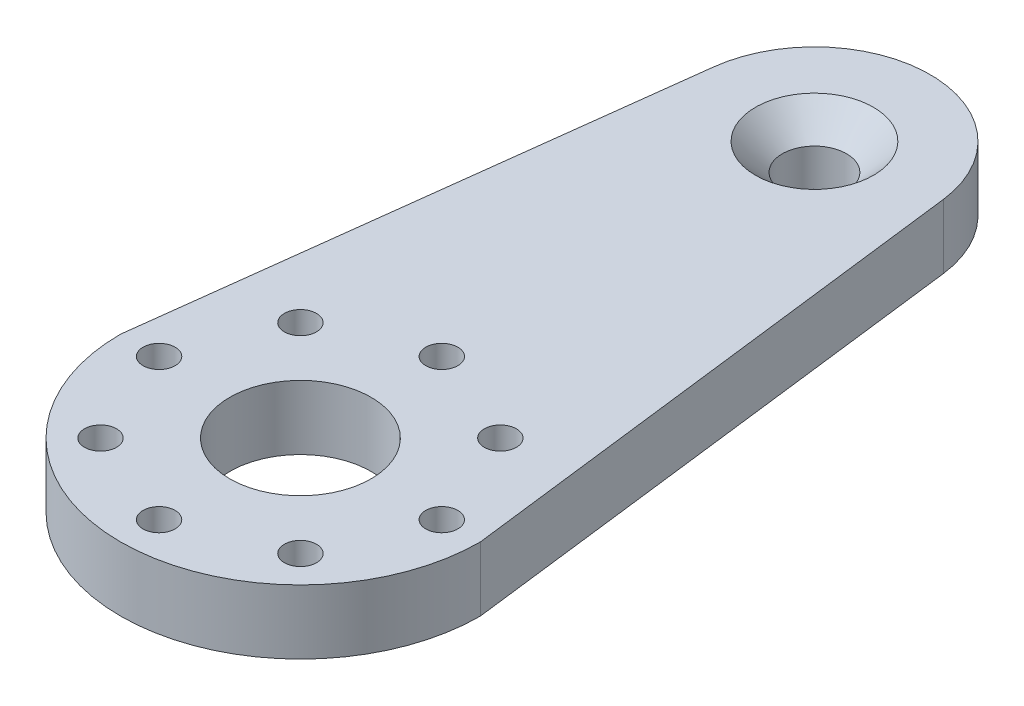
ISO-10303-21;
HEADER;
FILE_DESCRIPTION(('STEP AP214'),'2;1');
FILE_NAME('part.step','',(''),(''),'','','');
FILE_SCHEMA(('AUTOMOTIVE_DESIGN { 1 0 10303 214 1 1 1 1 }'));
ENDSEC;
DATA;
#1=APPLICATION_CONTEXT('core data for automotive mechanical design processes');
#2=APPLICATION_PROTOCOL_DEFINITION('international standard','automotive_design',2000,#1);
#3=PRODUCT_CONTEXT('',#1,'mechanical');
#4=PRODUCT('Part','Part','',(#3));
#5=PRODUCT_RELATED_PRODUCT_CATEGORY('part','',(#4));
#6=PRODUCT_DEFINITION_FORMATION('','',#4);
#7=PRODUCT_DEFINITION_CONTEXT('part definition',#1,'design');
#8=PRODUCT_DEFINITION('design','',#6,#7);
#9=PRODUCT_DEFINITION_SHAPE('','',#8);
#10=(LENGTH_UNIT() NAMED_UNIT(*) SI_UNIT(.MILLI.,.METRE.));
#11=(NAMED_UNIT(*) PLANE_ANGLE_UNIT() SI_UNIT($,.RADIAN.));
#12=(NAMED_UNIT(*) SI_UNIT($,.STERADIAN.) SOLID_ANGLE_UNIT());
#13=UNCERTAINTY_MEASURE_WITH_UNIT(LENGTH_MEASURE(1.E-05),#10,'distance_accuracy_value','');
#14=(GEOMETRIC_REPRESENTATION_CONTEXT(3) GLOBAL_UNCERTAINTY_ASSIGNED_CONTEXT((#13)) GLOBAL_UNIT_ASSIGNED_CONTEXT((#10,
#11,#12)) REPRESENTATION_CONTEXT('',''));
#15=CARTESIAN_POINT('',(0.,0.,0.));
#16=DIRECTION('',(0.,0.,1.));
#17=DIRECTION('',(1.,0.,0.));
#18=AXIS2_PLACEMENT_3D('',#15,#16,#17);
#19=CARTESIAN_POINT('',(0.,5.,0.));
#20=DIRECTION('',(0.,1.,0.));
#21=DIRECTION('',(0.,0.,1.));
#22=AXIS2_PLACEMENT_3D('',#19,#20,#21);
#23=PLANE('',#22);
#24=CARTESIAN_POINT('',(0.,5.,-40.));
#25=DIRECTION('',(0.,1.,0.));
#26=DIRECTION('',(0.,0.,1.));
#27=AXIS2_PLACEMENT_3D('',#24,#25,#26);
#28=CIRCLE('',#27,4.59);
#29=CARTESIAN_POINT('',(0.,5.,-35.41));
#30=VERTEX_POINT('',#29);
#31=EDGE_CURVE('E98',#30,#30,#28,.T.);
#32=ORIENTED_EDGE('',*,*,#31,.F.);
#33=EDGE_LOOP('',(#32));
#34=FACE_BOUND('',#33,.T.);
#35=DIRECTION('',(0.122369609545525,0.,-0.992484598701499));
#36=VECTOR('',#35,1.);
#37=CARTESIAN_POINT('',(-13.7903595012355,5.,-1.70029933952269));
#38=LINE('',#37,#36);
#39=CARTESIAN_POINT('',(-14.,5.,0.));
#40=VERTEX_POINT('',#39);
#41=CARTESIAN_POINT('',(-8.93236138831349,5.,-41.1013264859097));
#42=VERTEX_POINT('',#41);
#43=EDGE_CURVE('E93',#40,#42,#38,.T.);
#44=ORIENTED_EDGE('',*,*,#43,.F.);
#45=CARTESIAN_POINT('',(0.,5.,0.));
#46=DIRECTION('',(0.,1.,0.));
#47=DIRECTION('',(0.,0.,1.));
#48=AXIS2_PLACEMENT_3D('',#45,#46,#47);
#49=CIRCLE('',#48,14.);
#50=CARTESIAN_POINT('',(14.,5.,0.));
#51=VERTEX_POINT('',#50);
#52=EDGE_CURVE('E162',#40,#51,#49,.T.);
#53=ORIENTED_EDGE('',*,*,#52,.T.);
#54=DIRECTION('',(-0.122369609545525,0.,-0.992484598701499));
#55=VECTOR('',#54,1.);
#56=CARTESIAN_POINT('',(13.7903595012355,5.,-1.70029933952269));
#57=LINE('',#56,#55);
#58=CARTESIAN_POINT('',(8.93236138831349,5.,-41.1013264859097));
#59=VERTEX_POINT('',#58);
#60=EDGE_CURVE('E95',#51,#59,#57,.T.);
#61=ORIENTED_EDGE('',*,*,#60,.T.);
#62=CARTESIAN_POINT('',(0.,5.,-40.));
#63=DIRECTION('',(0.,1.,0.));
#64=DIRECTION('',(0.,0.,1.));
#65=AXIS2_PLACEMENT_3D('',#62,#63,#64);
#66=CIRCLE('',#65,9.);
#67=EDGE_CURVE('E88',#59,#42,#66,.T.);
#68=ORIENTED_EDGE('',*,*,#67,.T.);
#69=EDGE_LOOP('',(#44,#53,#61,#68));
#70=FACE_BOUND('',#69,.T.);
#71=CARTESIAN_POINT('',(-7.77817459305202,5.,-7.77817459305202));
#72=DIRECTION('',(0.,1.,0.));
#73=DIRECTION('',(0.,0.,1.));
#74=AXIS2_PLACEMENT_3D('',#71,#72,#73);
#75=CIRCLE('',#74,1.25);
#76=CARTESIAN_POINT('',(-7.77817459305202,5.,-6.52817459305202));
#77=VERTEX_POINT('',#76);
#78=EDGE_CURVE('E103',#77,#77,#75,.T.);
#79=ORIENTED_EDGE('',*,*,#78,.F.);
#80=EDGE_LOOP('',(#79));
#81=FACE_BOUND('',#80,.T.);
#82=CARTESIAN_POINT('',(-11.,5.,0.));
#83=DIRECTION('',(0.,1.,0.));
#84=DIRECTION('',(0.,0.,1.));
#85=AXIS2_PLACEMENT_3D('',#82,#83,#84);
#86=CIRCLE('',#85,1.25);
#87=CARTESIAN_POINT('',(-11.,5.,1.25));
#88=VERTEX_POINT('',#87);
#89=EDGE_CURVE('E108',#88,#88,#86,.T.);
#90=ORIENTED_EDGE('',*,*,#89,.F.);
#91=EDGE_LOOP('',(#90));
#92=FACE_BOUND('',#91,.T.);
#93=CARTESIAN_POINT('',(-7.77817459305202,5.,7.77817459305202));
#94=DIRECTION('',(0.,1.,0.));
#95=DIRECTION('',(0.,0.,1.));
#96=AXIS2_PLACEMENT_3D('',#93,#94,#95);
#97=CIRCLE('',#96,1.25);
#98=CARTESIAN_POINT('',(-7.77817459305202,5.,9.02817459305202));
#99=VERTEX_POINT('',#98);
#100=EDGE_CURVE('E114',#99,#99,#97,.T.);
#101=ORIENTED_EDGE('',*,*,#100,.F.);
#102=EDGE_LOOP('',(#101));
#103=FACE_BOUND('',#102,.T.);
#104=CARTESIAN_POINT('',(0.,5.,11.));
#105=DIRECTION('',(0.,1.,0.));
#106=DIRECTION('',(0.,0.,1.));
#107=AXIS2_PLACEMENT_3D('',#104,#105,#106);
#108=CIRCLE('',#107,1.25);
#109=CARTESIAN_POINT('',(0.,5.,12.25));
#110=VERTEX_POINT('',#109);
#111=EDGE_CURVE('E120',#110,#110,#108,.T.);
#112=ORIENTED_EDGE('',*,*,#111,.F.);
#113=EDGE_LOOP('',(#112));
#114=FACE_BOUND('',#113,.T.);
#115=CARTESIAN_POINT('',(7.77817459305202,5.,7.77817459305202));
#116=DIRECTION('',(0.,1.,0.));
#117=DIRECTION('',(0.,0.,1.));
#118=AXIS2_PLACEMENT_3D('',#115,#116,#117);
#119=CIRCLE('',#118,1.25);
#120=CARTESIAN_POINT('',(7.77817459305202,5.,9.02817459305202));
#121=VERTEX_POINT('',#120);
#122=EDGE_CURVE('E126',#121,#121,#119,.T.);
#123=ORIENTED_EDGE('',*,*,#122,.F.);
#124=EDGE_LOOP('',(#123));
#125=FACE_BOUND('',#124,.T.);
#126=CARTESIAN_POINT('',(11.,5.,0.));
#127=DIRECTION('',(0.,1.,0.));
#128=DIRECTION('',(0.,0.,1.));
#129=AXIS2_PLACEMENT_3D('',#126,#127,#128);
#130=CIRCLE('',#129,1.25);
#131=CARTESIAN_POINT('',(11.,5.,1.25));
#132=VERTEX_POINT('',#131);
#133=EDGE_CURVE('E132',#132,#132,#130,.T.);
#134=ORIENTED_EDGE('',*,*,#133,.F.);
#135=EDGE_LOOP('',(#134));
#136=FACE_BOUND('',#135,.T.);
#137=CARTESIAN_POINT('',(7.77817459305202,5.,-7.77817459305202));
#138=DIRECTION('',(0.,1.,0.));
#139=DIRECTION('',(0.,0.,1.));
#140=AXIS2_PLACEMENT_3D('',#137,#138,#139);
#141=CIRCLE('',#140,1.25);
#142=CARTESIAN_POINT('',(7.77817459305202,5.,-6.52817459305202));
#143=VERTEX_POINT('',#142);
#144=EDGE_CURVE('E138',#143,#143,#141,.T.);
#145=ORIENTED_EDGE('',*,*,#144,.F.);
#146=EDGE_LOOP('',(#145));
#147=FACE_BOUND('',#146,.T.);
#148=CARTESIAN_POINT('',(0.,5.,-11.));
#149=DIRECTION('',(0.,1.,0.));
#150=DIRECTION('',(0.,0.,1.));
#151=AXIS2_PLACEMENT_3D('',#148,#149,#150);
#152=CIRCLE('',#151,1.25);
#153=CARTESIAN_POINT('',(0.,5.,-9.75));
#154=VERTEX_POINT('',#153);
#155=EDGE_CURVE('E144',#154,#154,#152,.T.);
#156=ORIENTED_EDGE('',*,*,#155,.F.);
#157=EDGE_LOOP('',(#156));
#158=FACE_BOUND('',#157,.T.);
#159=CARTESIAN_POINT('',(0.,5.,0.));
#160=DIRECTION('',(0.,1.,0.));
#161=DIRECTION('',(0.,0.,1.));
#162=AXIS2_PLACEMENT_3D('',#159,#160,#161);
#163=CIRCLE('',#162,5.5);
#164=CARTESIAN_POINT('',(0.,5.,5.5));
#165=VERTEX_POINT('',#164);
#166=EDGE_CURVE('E153',#165,#165,#163,.T.);
#167=ORIENTED_EDGE('',*,*,#166,.F.);
#168=EDGE_LOOP('',(#167));
#169=FACE_BOUND('',#168,.T.);
#170=ADVANCED_FACE('F34',(#34,#70,#81,#92,#103,#114,#125,#136,#147,#158,#169),#23,.T.);
#171=CARTESIAN_POINT('',(0.,0.,0.));
#172=DIRECTION('',(0.,1.,0.));
#173=DIRECTION('',(0.,0.,1.));
#174=AXIS2_PLACEMENT_3D('',#171,#172,#173);
#175=PLANE('',#174);
#176=CARTESIAN_POINT('',(-7.77817459305202,0.,-7.77817459305202));
#177=DIRECTION('',(0.,1.,0.));
#178=DIRECTION('',(0.,0.,1.));
#179=AXIS2_PLACEMENT_3D('',#176,#177,#178);
#180=CIRCLE('',#179,1.25);
#181=CARTESIAN_POINT('',(-7.77817459305202,0.,-6.52817459305202));
#182=VERTEX_POINT('',#181);
#183=EDGE_CURVE('E105',#182,#182,#180,.T.);
#184=ORIENTED_EDGE('',*,*,#183,.T.);
#185=EDGE_LOOP('',(#184));
#186=FACE_BOUND('',#185,.T.);
#187=CARTESIAN_POINT('',(-11.,0.,0.));
#188=DIRECTION('',(0.,1.,0.));
#189=DIRECTION('',(0.,0.,1.));
#190=AXIS2_PLACEMENT_3D('',#187,#188,#189);
#191=CIRCLE('',#190,1.25);
#192=CARTESIAN_POINT('',(-11.,0.,1.25));
#193=VERTEX_POINT('',#192);
#194=EDGE_CURVE('E111',#193,#193,#191,.T.);
#195=ORIENTED_EDGE('',*,*,#194,.T.);
#196=EDGE_LOOP('',(#195));
#197=FACE_BOUND('',#196,.T.);
#198=CARTESIAN_POINT('',(-7.77817459305202,0.,7.77817459305202));
#199=DIRECTION('',(0.,1.,0.));
#200=DIRECTION('',(0.,0.,1.));
#201=AXIS2_PLACEMENT_3D('',#198,#199,#200);
#202=CIRCLE('',#201,1.25);
#203=CARTESIAN_POINT('',(-7.77817459305202,0.,9.02817459305202));
#204=VERTEX_POINT('',#203);
#205=EDGE_CURVE('E117',#204,#204,#202,.T.);
#206=ORIENTED_EDGE('',*,*,#205,.T.);
#207=EDGE_LOOP('',(#206));
#208=FACE_BOUND('',#207,.T.);
#209=CARTESIAN_POINT('',(0.,0.,11.));
#210=DIRECTION('',(0.,1.,0.));
#211=DIRECTION('',(0.,0.,1.));
#212=AXIS2_PLACEMENT_3D('',#209,#210,#211);
#213=CIRCLE('',#212,1.25);
#214=CARTESIAN_POINT('',(0.,0.,12.25));
#215=VERTEX_POINT('',#214);
#216=EDGE_CURVE('E123',#215,#215,#213,.T.);
#217=ORIENTED_EDGE('',*,*,#216,.T.);
#218=EDGE_LOOP('',(#217));
#219=FACE_BOUND('',#218,.T.);
#220=CARTESIAN_POINT('',(7.77817459305202,0.,7.77817459305202));
#221=DIRECTION('',(0.,1.,0.));
#222=DIRECTION('',(0.,0.,1.));
#223=AXIS2_PLACEMENT_3D('',#220,#221,#222);
#224=CIRCLE('',#223,1.25);
#225=CARTESIAN_POINT('',(7.77817459305202,0.,9.02817459305202));
#226=VERTEX_POINT('',#225);
#227=EDGE_CURVE('E129',#226,#226,#224,.T.);
#228=ORIENTED_EDGE('',*,*,#227,.T.);
#229=EDGE_LOOP('',(#228));
#230=FACE_BOUND('',#229,.T.);
#231=CARTESIAN_POINT('',(11.,0.,0.));
#232=DIRECTION('',(0.,1.,0.));
#233=DIRECTION('',(0.,0.,1.));
#234=AXIS2_PLACEMENT_3D('',#231,#232,#233);
#235=CIRCLE('',#234,1.25);
#236=CARTESIAN_POINT('',(11.,0.,1.25));
#237=VERTEX_POINT('',#236);
#238=EDGE_CURVE('E135',#237,#237,#235,.T.);
#239=ORIENTED_EDGE('',*,*,#238,.T.);
#240=EDGE_LOOP('',(#239));
#241=FACE_BOUND('',#240,.T.);
#242=CARTESIAN_POINT('',(7.77817459305202,0.,-7.77817459305202));
#243=DIRECTION('',(0.,1.,0.));
#244=DIRECTION('',(0.,0.,1.));
#245=AXIS2_PLACEMENT_3D('',#242,#243,#244);
#246=CIRCLE('',#245,1.25);
#247=CARTESIAN_POINT('',(7.77817459305202,0.,-6.52817459305202));
#248=VERTEX_POINT('',#247);
#249=EDGE_CURVE('E141',#248,#248,#246,.T.);
#250=ORIENTED_EDGE('',*,*,#249,.T.);
#251=EDGE_LOOP('',(#250));
#252=FACE_BOUND('',#251,.T.);
#253=CARTESIAN_POINT('',(0.,0.,-11.));
#254=DIRECTION('',(0.,1.,0.));
#255=DIRECTION('',(0.,0.,1.));
#256=AXIS2_PLACEMENT_3D('',#253,#254,#255);
#257=CIRCLE('',#256,1.25);
#258=CARTESIAN_POINT('',(0.,0.,-9.75));
#259=VERTEX_POINT('',#258);
#260=EDGE_CURVE('E147',#259,#259,#257,.T.);
#261=ORIENTED_EDGE('',*,*,#260,.T.);
#262=EDGE_LOOP('',(#261));
#263=FACE_BOUND('',#262,.T.);
#264=CARTESIAN_POINT('',(0.,0.,-40.));
#265=DIRECTION('',(0.,1.,0.));
#266=DIRECTION('',(0.,0.,1.));
#267=AXIS2_PLACEMENT_3D('',#264,#265,#266);
#268=CIRCLE('',#267,2.5);
#269=CARTESIAN_POINT('',(0.,0.,-37.5));
#270=VERTEX_POINT('',#269);
#271=EDGE_CURVE('E156',#270,#270,#268,.T.);
#272=ORIENTED_EDGE('',*,*,#271,.T.);
#273=EDGE_LOOP('',(#272));
#274=FACE_BOUND('',#273,.T.);
#275=CARTESIAN_POINT('',(0.,0.,0.));
#276=DIRECTION('',(0.,1.,0.));
#277=DIRECTION('',(0.,0.,1.));
#278=AXIS2_PLACEMENT_3D('',#275,#276,#277);
#279=CIRCLE('',#278,14.);
#280=CARTESIAN_POINT('',(-14.,0.,0.));
#281=VERTEX_POINT('',#280);
#282=CARTESIAN_POINT('',(14.,0.,0.));
#283=VERTEX_POINT('',#282);
#284=EDGE_CURVE('E161',#281,#283,#279,.T.);
#285=ORIENTED_EDGE('',*,*,#284,.F.);
#286=DIRECTION('',(0.122369609545525,0.,-0.992484598701499));
#287=VECTOR('',#286,1.);
#288=CARTESIAN_POINT('',(-13.7903595012355,0.,-1.70029933952269));
#289=LINE('',#288,#287);
#290=CARTESIAN_POINT('',(-8.93236138831349,0.,-41.1013264859097));
#291=VERTEX_POINT('',#290);
#292=EDGE_CURVE('E50',#281,#291,#289,.T.);
#293=ORIENTED_EDGE('',*,*,#292,.T.);
#294=CARTESIAN_POINT('',(0.,0.,-40.));
#295=DIRECTION('',(0.,1.,0.));
#296=DIRECTION('',(0.,0.,1.));
#297=AXIS2_PLACEMENT_3D('',#294,#295,#296);
#298=CIRCLE('',#297,9.);
#299=CARTESIAN_POINT('',(8.93236138831349,0.,-41.1013264859097));
#300=VERTEX_POINT('',#299);
#301=EDGE_CURVE('E59',#300,#291,#298,.T.);
#302=ORIENTED_EDGE('',*,*,#301,.F.);
#303=DIRECTION('',(-0.122369609545525,0.,-0.992484598701499));
#304=VECTOR('',#303,1.);
#305=CARTESIAN_POINT('',(13.7903595012355,0.,-1.70029933952269));
#306=LINE('',#305,#304);
#307=EDGE_CURVE('E78',#283,#300,#306,.T.);
#308=ORIENTED_EDGE('',*,*,#307,.F.);
#309=EDGE_LOOP('',(#285,#293,#302,#308));
#310=FACE_BOUND('',#309,.T.);
#311=CARTESIAN_POINT('',(0.,0.,0.));
#312=DIRECTION('',(0.,1.,0.));
#313=DIRECTION('',(0.,0.,1.));
#314=AXIS2_PLACEMENT_3D('',#311,#312,#313);
#315=CIRCLE('',#314,5.5);
#316=CARTESIAN_POINT('',(0.,0.,5.5));
#317=VERTEX_POINT('',#316);
#318=EDGE_CURVE('E150',#317,#317,#315,.T.);
#319=ORIENTED_EDGE('',*,*,#318,.T.);
#320=EDGE_LOOP('',(#319));
#321=FACE_BOUND('',#320,.T.);
#322=ADVANCED_FACE('F91',(#186,#197,#208,#219,#230,#241,#252,#263,#274,#310,#321),#175,.F.);
#323=CARTESIAN_POINT('',(0.,5.,0.));
#324=DIRECTION('',(0.,-1.,0.));
#325=DIRECTION('',(0.,0.,-1.));
#326=AXIS2_PLACEMENT_3D('',#323,#324,#325);
#327=CYLINDRICAL_SURFACE('',#326,14.);
#328=ORIENTED_EDGE('',*,*,#284,.T.);
#329=DIRECTION('',(0.,-1.,0.));
#330=VECTOR('',#329,1.);
#331=CARTESIAN_POINT('',(14.,5.,0.));
#332=LINE('',#331,#330);
#333=EDGE_CURVE('E11',#51,#283,#332,.T.);
#334=ORIENTED_EDGE('',*,*,#333,.F.);
#335=ORIENTED_EDGE('',*,*,#52,.F.);
#336=DIRECTION('',(0.,-1.,0.));
#337=VECTOR('',#336,1.);
#338=CARTESIAN_POINT('',(-14.,5.,0.));
#339=LINE('',#338,#337);
#340=EDGE_CURVE('E43',#40,#281,#339,.T.);
#341=ORIENTED_EDGE('',*,*,#340,.T.);
#342=EDGE_LOOP('',(#328,#334,#335,#341));
#343=FACE_BOUND('',#342,.T.);
#344=ADVANCED_FACE('F36',(#343),#327,.T.);
#345=CARTESIAN_POINT('',(0.,5.,-40.));
#346=DIRECTION('',(0.,-1.,0.));
#347=DIRECTION('',(0.,0.,-1.));
#348=AXIS2_PLACEMENT_3D('',#345,#346,#347);
#349=CYLINDRICAL_SURFACE('',#348,2.5);
#350=CARTESIAN_POINT('',(0.,2.91,-40.));
#351=DIRECTION('',(0.,1.,0.));
#352=DIRECTION('',(0.,0.,1.));
#353=AXIS2_PLACEMENT_3D('',#350,#351,#352);
#354=CIRCLE('',#353,2.5);
#355=CARTESIAN_POINT('',(0.,2.91,-37.5));
#356=VERTEX_POINT('',#355);
#357=EDGE_CURVE('E38',#356,#356,#354,.F.);
#358=ORIENTED_EDGE('',*,*,#357,.F.);
#359=EDGE_LOOP('',(#358));
#360=FACE_BOUND('',#359,.T.);
#361=ORIENTED_EDGE('',*,*,#271,.F.);
#362=EDGE_LOOP('',(#361));
#363=FACE_BOUND('',#362,.T.);
#364=ADVANCED_FACE('F197',(#360,#363),#349,.F.);
#365=CARTESIAN_POINT('',(0.,5.,0.));
#366=DIRECTION('',(0.,-1.,0.));
#367=DIRECTION('',(0.,0.,-1.));
#368=AXIS2_PLACEMENT_3D('',#365,#366,#367);
#369=CYLINDRICAL_SURFACE('',#368,5.5);
#370=ORIENTED_EDGE('',*,*,#166,.T.);
#371=EDGE_LOOP('',(#370));
#372=FACE_BOUND('',#371,.T.);
#373=ORIENTED_EDGE('',*,*,#318,.F.);
#374=EDGE_LOOP('',(#373));
#375=FACE_BOUND('',#374,.T.);
#376=ADVANCED_FACE('F193',(#372,#375),#369,.F.);
#377=CARTESIAN_POINT('',(0.,0.,-11.));
#378=DIRECTION('',(0.,1.,0.));
#379=DIRECTION('',(0.,0.,1.));
#380=AXIS2_PLACEMENT_3D('',#377,#378,#379);
#381=CYLINDRICAL_SURFACE('',#380,1.25);
#382=ORIENTED_EDGE('',*,*,#260,.F.);
#383=EDGE_LOOP('',(#382));
#384=FACE_BOUND('',#383,.T.);
#385=ORIENTED_EDGE('',*,*,#155,.T.);
#386=EDGE_LOOP('',(#385));
#387=FACE_BOUND('',#386,.T.);
#388=ADVANCED_FACE('F196',(#384,#387),#381,.F.);
#389=CARTESIAN_POINT('',(7.77817459305202,0.,-7.77817459305202));
#390=DIRECTION('',(0.,1.,0.));
#391=DIRECTION('',(0.,0.,1.));
#392=AXIS2_PLACEMENT_3D('',#389,#390,#391);
#393=CYLINDRICAL_SURFACE('',#392,1.25);
#394=ORIENTED_EDGE('',*,*,#249,.F.);
#395=EDGE_LOOP('',(#394));
#396=FACE_BOUND('',#395,.T.);
#397=ORIENTED_EDGE('',*,*,#144,.T.);
#398=EDGE_LOOP('',(#397));
#399=FACE_BOUND('',#398,.T.);
#400=ADVANCED_FACE('F212',(#396,#399),#393,.F.);
#401=CARTESIAN_POINT('',(11.,0.,0.));
#402=DIRECTION('',(0.,1.,0.));
#403=DIRECTION('',(0.,0.,1.));
#404=AXIS2_PLACEMENT_3D('',#401,#402,#403);
#405=CYLINDRICAL_SURFACE('',#404,1.25);
#406=ORIENTED_EDGE('',*,*,#238,.F.);
#407=EDGE_LOOP('',(#406));
#408=FACE_BOUND('',#407,.T.);
#409=ORIENTED_EDGE('',*,*,#133,.T.);
#410=EDGE_LOOP('',(#409));
#411=FACE_BOUND('',#410,.T.);
#412=ADVANCED_FACE('F216',(#408,#411),#405,.F.);
#413=CARTESIAN_POINT('',(7.77817459305202,0.,7.77817459305202));
#414=DIRECTION('',(0.,1.,0.));
#415=DIRECTION('',(0.,0.,1.));
#416=AXIS2_PLACEMENT_3D('',#413,#414,#415);
#417=CYLINDRICAL_SURFACE('',#416,1.25);
#418=ORIENTED_EDGE('',*,*,#227,.F.);
#419=EDGE_LOOP('',(#418));
#420=FACE_BOUND('',#419,.T.);
#421=ORIENTED_EDGE('',*,*,#122,.T.);
#422=EDGE_LOOP('',(#421));
#423=FACE_BOUND('',#422,.T.);
#424=ADVANCED_FACE('F220',(#420,#423),#417,.F.);
#425=CARTESIAN_POINT('',(0.,0.,11.));
#426=DIRECTION('',(0.,1.,0.));
#427=DIRECTION('',(0.,0.,1.));
#428=AXIS2_PLACEMENT_3D('',#425,#426,#427);
#429=CYLINDRICAL_SURFACE('',#428,1.25);
#430=ORIENTED_EDGE('',*,*,#216,.F.);
#431=EDGE_LOOP('',(#430));
#432=FACE_BOUND('',#431,.T.);
#433=ORIENTED_EDGE('',*,*,#111,.T.);
#434=EDGE_LOOP('',(#433));
#435=FACE_BOUND('',#434,.T.);
#436=ADVANCED_FACE('F224',(#432,#435),#429,.F.);
#437=CARTESIAN_POINT('',(-7.77817459305202,0.,7.77817459305202));
#438=DIRECTION('',(0.,1.,0.));
#439=DIRECTION('',(0.,0.,1.));
#440=AXIS2_PLACEMENT_3D('',#437,#438,#439);
#441=CYLINDRICAL_SURFACE('',#440,1.25);
#442=ORIENTED_EDGE('',*,*,#205,.F.);
#443=EDGE_LOOP('',(#442));
#444=FACE_BOUND('',#443,.T.);
#445=ORIENTED_EDGE('',*,*,#100,.T.);
#446=EDGE_LOOP('',(#445));
#447=FACE_BOUND('',#446,.T.);
#448=ADVANCED_FACE('F228',(#444,#447),#441,.F.);
#449=CARTESIAN_POINT('',(-11.,0.,0.));
#450=DIRECTION('',(0.,1.,0.));
#451=DIRECTION('',(0.,0.,1.));
#452=AXIS2_PLACEMENT_3D('',#449,#450,#451);
#453=CYLINDRICAL_SURFACE('',#452,1.25);
#454=ORIENTED_EDGE('',*,*,#194,.F.);
#455=EDGE_LOOP('',(#454));
#456=FACE_BOUND('',#455,.T.);
#457=ORIENTED_EDGE('',*,*,#89,.T.);
#458=EDGE_LOOP('',(#457));
#459=FACE_BOUND('',#458,.T.);
#460=ADVANCED_FACE('F232',(#456,#459),#453,.F.);
#461=CARTESIAN_POINT('',(-7.77817459305202,0.,-7.77817459305202));
#462=DIRECTION('',(0.,1.,0.));
#463=DIRECTION('',(0.,0.,1.));
#464=AXIS2_PLACEMENT_3D('',#461,#462,#463);
#465=CYLINDRICAL_SURFACE('',#464,1.25);
#466=ORIENTED_EDGE('',*,*,#183,.F.);
#467=EDGE_LOOP('',(#466));
#468=FACE_BOUND('',#467,.T.);
#469=ORIENTED_EDGE('',*,*,#78,.T.);
#470=EDGE_LOOP('',(#469));
#471=FACE_BOUND('',#470,.T.);
#472=ADVANCED_FACE('F236',(#468,#471),#465,.F.);
#473=CARTESIAN_POINT('',(0.,0.,-40.));
#474=DIRECTION('',(0.,1.,0.));
#475=DIRECTION('',(0.,0.,1.));
#476=AXIS2_PLACEMENT_3D('',#473,#474,#475);
#477=CYLINDRICAL_SURFACE('',#476,9.);
#478=ORIENTED_EDGE('',*,*,#67,.F.);
#479=DIRECTION('',(0.,1.,0.));
#480=VECTOR('',#479,1.);
#481=CARTESIAN_POINT('',(8.93236138831349,0.,-41.1013264859097));
#482=LINE('',#481,#480);
#483=EDGE_CURVE('E80',#300,#59,#482,.T.);
#484=ORIENTED_EDGE('',*,*,#483,.F.);
#485=ORIENTED_EDGE('',*,*,#301,.T.);
#486=DIRECTION('',(0.,1.,0.));
#487=VECTOR('',#486,1.);
#488=CARTESIAN_POINT('',(-8.93236138831349,0.,-41.1013264859097));
#489=LINE('',#488,#487);
#490=EDGE_CURVE('E73',#291,#42,#489,.T.);
#491=ORIENTED_EDGE('',*,*,#490,.T.);
#492=EDGE_LOOP('',(#478,#484,#485,#491));
#493=FACE_BOUND('',#492,.T.);
#494=ADVANCED_FACE('F86',(#493),#477,.T.);
#495=CARTESIAN_POINT('',(-13.7903595012355,0.,-1.70029933952269));
#496=DIRECTION('',(0.992484598701499,0.,0.122369609545525));
#497=DIRECTION('',(0.122369609545525,0.,-0.992484598701499));
#498=AXIS2_PLACEMENT_3D('',#495,#496,#497);
#499=PLANE('',#498);
#500=ORIENTED_EDGE('',*,*,#43,.T.);
#501=ORIENTED_EDGE('',*,*,#490,.F.);
#502=ORIENTED_EDGE('',*,*,#292,.F.);
#503=ORIENTED_EDGE('',*,*,#340,.F.);
#504=EDGE_LOOP('',(#500,#501,#502,#503));
#505=FACE_BOUND('',#504,.T.);
#506=ADVANCED_FACE('F169',(#505),#499,.F.);
#507=CARTESIAN_POINT('',(13.7903595012355,0.,-1.70029933952269));
#508=DIRECTION('',(0.992484598701499,0.,-0.122369609545525));
#509=DIRECTION('',(-0.122369609545525,0.,-0.992484598701499));
#510=AXIS2_PLACEMENT_3D('',#507,#508,#509);
#511=PLANE('',#510);
#512=ORIENTED_EDGE('',*,*,#60,.F.);
#513=ORIENTED_EDGE('',*,*,#333,.T.);
#514=ORIENTED_EDGE('',*,*,#307,.T.);
#515=ORIENTED_EDGE('',*,*,#483,.T.);
#516=EDGE_LOOP('',(#512,#513,#514,#515));
#517=FACE_BOUND('',#516,.T.);
#518=ADVANCED_FACE('F79',(#517),#511,.T.);
#519=CARTESIAN_POINT('',(0.,5.,-40.));
#520=DIRECTION('',(0.,1.,0.));
#521=DIRECTION('',(0.,0.,1.));
#522=AXIS2_PLACEMENT_3D('',#519,#520,#521);
#523=CONICAL_SURFACE('',#522,4.59,0.785398163397449);
#524=ORIENTED_EDGE('',*,*,#357,.T.);
#525=EDGE_LOOP('',(#524));
#526=FACE_BOUND('',#525,.T.);
#527=ORIENTED_EDGE('',*,*,#31,.T.);
#528=EDGE_LOOP('',(#527));
#529=FACE_BOUND('',#528,.T.);
#530=ADVANCED_FACE('F245',(#526,#529),#523,.F.);
#531=CLOSED_SHELL('',(#170,#322,#344,#364,#376,#388,#400,#412,#424,#436,#448,#460,#472,#494,
#506,#518,#530));
#532=MANIFOLD_SOLID_BREP('B2',#531);
#533=ADVANCED_BREP_SHAPE_REPRESENTATION('',(#18,#532),#14);
#534=SHAPE_DEFINITION_REPRESENTATION(#9,#533);
ENDSEC;
END-ISO-10303-21;
